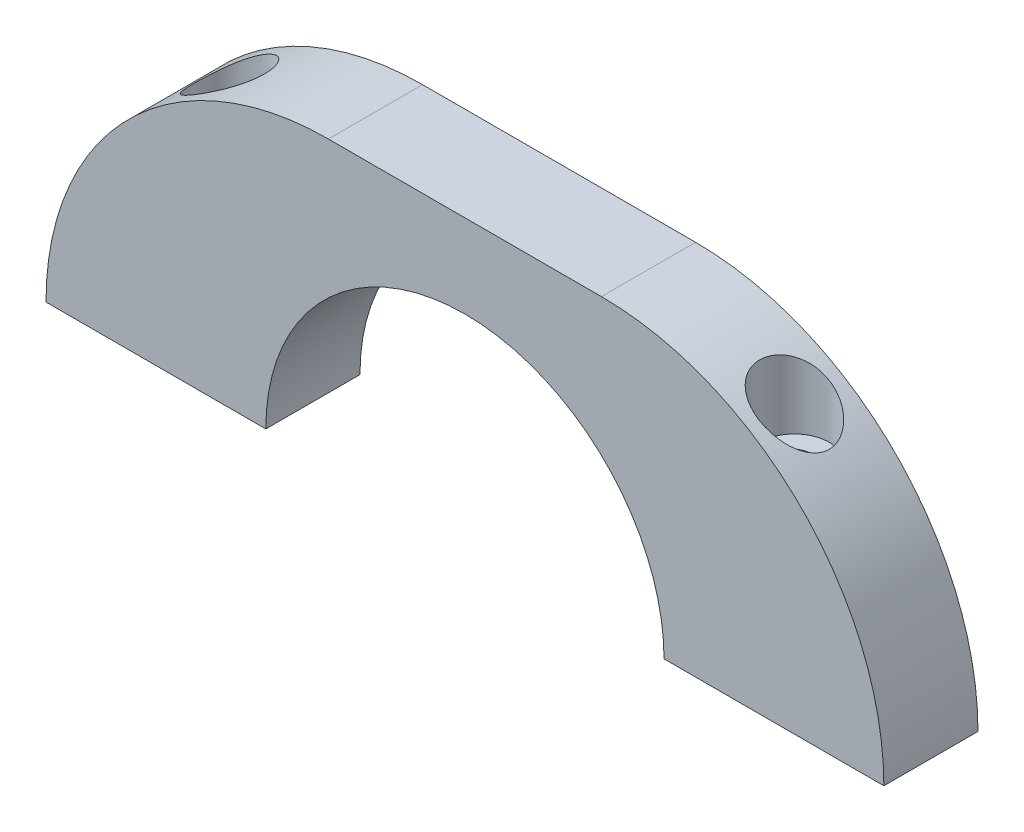
ISO-10303-21;
HEADER;
FILE_DESCRIPTION(('STEP AP214'),'2;1');
FILE_NAME('part.step','',(''),(''),'','','');
FILE_SCHEMA(('AUTOMOTIVE_DESIGN { 1 0 10303 214 1 1 1 1 }'));
ENDSEC;
DATA;
#1=APPLICATION_CONTEXT('core data for automotive mechanical design processes');
#2=APPLICATION_PROTOCOL_DEFINITION('international standard','automotive_design',2000,#1);
#3=PRODUCT_CONTEXT('',#1,'mechanical');
#4=PRODUCT('Part','Part','',(#3));
#5=PRODUCT_RELATED_PRODUCT_CATEGORY('part','',(#4));
#6=PRODUCT_DEFINITION_FORMATION('','',#4);
#7=PRODUCT_DEFINITION_CONTEXT('part definition',#1,'design');
#8=PRODUCT_DEFINITION('design','',#6,#7);
#9=PRODUCT_DEFINITION_SHAPE('','',#8);
#10=(LENGTH_UNIT() NAMED_UNIT(*) SI_UNIT(.MILLI.,.METRE.));
#11=(NAMED_UNIT(*) PLANE_ANGLE_UNIT() SI_UNIT($,.RADIAN.));
#12=(NAMED_UNIT(*) SI_UNIT($,.STERADIAN.) SOLID_ANGLE_UNIT());
#13=UNCERTAINTY_MEASURE_WITH_UNIT(LENGTH_MEASURE(1.E-05),#10,'distance_accuracy_value','');
#14=(GEOMETRIC_REPRESENTATION_CONTEXT(3) GLOBAL_UNCERTAINTY_ASSIGNED_CONTEXT((#13)) GLOBAL_UNIT_ASSIGNED_CONTEXT((#10,
#11,#12)) REPRESENTATION_CONTEXT('',''));
#15=CARTESIAN_POINT('',(0.,0.,0.));
#16=DIRECTION('',(0.,0.,1.));
#17=DIRECTION('',(1.,0.,0.));
#18=AXIS2_PLACEMENT_3D('',#15,#16,#17);
#19=CARTESIAN_POINT('',(30.,60.,0.));
#20=DIRECTION('',(0.,-1.,0.));
#21=DIRECTION('',(0.,0.,-1.));
#22=AXIS2_PLACEMENT_3D('',#19,#20,#21);
#23=CYLINDRICAL_SURFACE('',#22,1.7);
#24=CARTESIAN_POINT('',(30.,0.,0.));
#25=DIRECTION('',(0.,-1.,0.));
#26=DIRECTION('',(0.,0.,-1.));
#27=AXIS2_PLACEMENT_3D('',#24,#25,#26);
#28=CIRCLE('',#27,1.7);
#29=CARTESIAN_POINT('',(30.,0.,-1.7));
#30=VERTEX_POINT('',#29);
#31=EDGE_CURVE('E140',#30,#30,#28,.T.);
#32=CARTESIAN_POINT('',(30.,20.,0.));
#33=DIRECTION('',(0.,1.,0.));
#34=DIRECTION('',(0.,0.,1.));
#35=AXIS2_PLACEMENT_3D('',#32,#33,#34);
#36=CIRCLE('',#35,1.7);
#37=CARTESIAN_POINT('',(30.,20.,-1.7));
#38=VERTEX_POINT('',#37);
#39=EDGE_CURVE('E142',#38,#38,#36,.F.);
#40=CARTESIAN_POINT('',(30.,0.,-1.7));
#41=CARTESIAN_POINT('',(30.,0.208333333333334,-1.7));
#42=CARTESIAN_POINT('',(30.,0.416666666666667,-1.7));
#43=CARTESIAN_POINT('',(30.,0.833333333333334,-1.7));
#44=CARTESIAN_POINT('',(30.,1.04166666666667,-1.7));
#45=CARTESIAN_POINT('',(30.,1.45833333333333,-1.7));
#46=CARTESIAN_POINT('',(30.,1.66666666666667,-1.7));
#47=CARTESIAN_POINT('',(30.,2.08333333333334,-1.7));
#48=CARTESIAN_POINT('',(30.,2.29166666666667,-1.7));
#49=CARTESIAN_POINT('',(30.,2.70833333333333,-1.7));
#50=CARTESIAN_POINT('',(30.,2.91666666666666,-1.7));
#51=CARTESIAN_POINT('',(30.,3.33333333333333,-1.7));
#52=CARTESIAN_POINT('',(30.,3.54166666666666,-1.7));
#53=CARTESIAN_POINT('',(30.,3.95833333333333,-1.7));
#54=CARTESIAN_POINT('',(30.,4.16666666666666,-1.7));
#55=CARTESIAN_POINT('',(30.,4.58333333333333,-1.7));
#56=CARTESIAN_POINT('',(30.,4.79166666666666,-1.7));
#57=CARTESIAN_POINT('',(30.,5.20833333333333,-1.7));
#58=CARTESIAN_POINT('',(30.,5.41666666666666,-1.7));
#59=CARTESIAN_POINT('',(30.,5.83333333333333,-1.7));
#60=CARTESIAN_POINT('',(30.,6.04166666666667,-1.7));
#61=CARTESIAN_POINT('',(30.,6.45833333333333,-1.7));
#62=CARTESIAN_POINT('',(30.,6.66666666666667,-1.7));
#63=CARTESIAN_POINT('',(30.,7.08333333333333,-1.7));
#64=CARTESIAN_POINT('',(30.,7.29166666666666,-1.7));
#65=CARTESIAN_POINT('',(30.,7.70833333333333,-1.7));
#66=CARTESIAN_POINT('',(30.,7.91666666666666,-1.7));
#67=CARTESIAN_POINT('',(30.,8.33333333333333,-1.7));
#68=CARTESIAN_POINT('',(30.,8.54166666666666,-1.7));
#69=CARTESIAN_POINT('',(30.,8.95833333333333,-1.7));
#70=CARTESIAN_POINT('',(30.,9.16666666666666,-1.7));
#71=CARTESIAN_POINT('',(30.,9.58333333333333,-1.7));
#72=CARTESIAN_POINT('',(30.,9.79166666666666,-1.7));
#73=CARTESIAN_POINT('',(30.,10.2083333333333,-1.7));
#74=CARTESIAN_POINT('',(30.,10.4166666666667,-1.7));
#75=CARTESIAN_POINT('',(30.,10.8333333333333,-1.7));
#76=CARTESIAN_POINT('',(30.,11.0416666666667,-1.7));
#77=CARTESIAN_POINT('',(30.,11.4583333333333,-1.7));
#78=CARTESIAN_POINT('',(30.,11.6666666666667,-1.7));
#79=CARTESIAN_POINT('',(30.,12.0833333333333,-1.7));
#80=CARTESIAN_POINT('',(30.,12.2916666666667,-1.7));
#81=CARTESIAN_POINT('',(30.,12.7083333333333,-1.7));
#82=CARTESIAN_POINT('',(30.,12.9166666666667,-1.7));
#83=CARTESIAN_POINT('',(30.,13.3333333333333,-1.7));
#84=CARTESIAN_POINT('',(30.,13.5416666666667,-1.7));
#85=CARTESIAN_POINT('',(30.,13.9583333333333,-1.7));
#86=CARTESIAN_POINT('',(30.,14.1666666666667,-1.7));
#87=CARTESIAN_POINT('',(30.,14.5833333333333,-1.7));
#88=CARTESIAN_POINT('',(30.,14.7916666666667,-1.7));
#89=CARTESIAN_POINT('',(30.,15.2083333333333,-1.7));
#90=CARTESIAN_POINT('',(30.,15.4166666666667,-1.7));
#91=CARTESIAN_POINT('',(30.,15.8333333333333,-1.7));
#92=CARTESIAN_POINT('',(30.,16.0416666666667,-1.7));
#93=CARTESIAN_POINT('',(30.,16.4583333333333,-1.7));
#94=CARTESIAN_POINT('',(30.,16.6666666666667,-1.7));
#95=CARTESIAN_POINT('',(30.,17.0833333333333,-1.7));
#96=CARTESIAN_POINT('',(30.,17.2916666666667,-1.7));
#97=CARTESIAN_POINT('',(30.,17.7083333333333,-1.7));
#98=CARTESIAN_POINT('',(30.,17.9166666666667,-1.7));
#99=CARTESIAN_POINT('',(30.,18.3333333333333,-1.7));
#100=CARTESIAN_POINT('',(30.,18.5416666666667,-1.7));
#101=CARTESIAN_POINT('',(30.,18.9583333333333,-1.7));
#102=CARTESIAN_POINT('',(30.,19.1666666666667,-1.7));
#103=CARTESIAN_POINT('',(30.,19.5833333333333,-1.7));
#104=CARTESIAN_POINT('',(30.,19.7916666666667,-1.7));
#105=CARTESIAN_POINT('',(30.,20.,-1.7));
#106=B_SPLINE_CURVE_WITH_KNOTS('',3,(#40,#41,#42,#43,#44,#45,#46,#47,#48,#49,#50,#51,#52,#53,
#54,#55,#56,#57,#58,#59,#60,#61,#62,#63,#64,#65,#66,#67,#68,#69,#70,#71,#72,#73,#74,#75,#76,#77,
#78,#79,#80,#81,#82,#83,#84,#85,#86,#87,#88,#89,#90,#91,#92,#93,#94,#95,#96,#97,#98,#99,#100,
#101,#102,#103,#104,#105),.UNSPECIFIED.,.F.,.F.,(4,2,2,2,2,2,2,2,2,2,2,2,2,2,2,2,2,2,2,2,2,2,2,
2,2,2,2,2,2,2,2,2,4),(0.,0.625000000000001,1.25,1.875,2.5,3.125,3.75,4.375,5.,5.625,6.25,6.875,
7.49999999999999,8.12499999999999,8.74999999999999,9.37499999999999,9.99999999999999,10.625,
11.25,11.875,12.5,13.125,13.75,14.375,15.,15.625,16.25,16.875,17.5,18.125,18.75,19.375,20.),.UNSPECIFIED.);
#107=EDGE_CURVE('BSEAM38',#30,#38,#106,.T.);
#108=ORIENTED_EDGE('',*,*,#31,.T.);
#109=ORIENTED_EDGE('',*,*,#39,.F.);
#110=ORIENTED_EDGE('',*,*,#107,.T.);
#111=ORIENTED_EDGE('',*,*,#107,.F.);
#112=EDGE_LOOP('',(#108,#110,#109,#111));
#113=FACE_BOUND('',#112,.T.);
#114=ADVANCED_FACE('F38',(#113),#23,.F.);
#115=CARTESIAN_POINT('',(-30.,60.,0.));
#116=DIRECTION('',(0.,-1.,0.));
#117=DIRECTION('',(0.,0.,-1.));
#118=AXIS2_PLACEMENT_3D('',#115,#116,#117);
#119=CYLINDRICAL_SURFACE('',#118,1.7);
#120=CARTESIAN_POINT('',(-30.,0.,0.));
#121=DIRECTION('',(0.,-1.,0.));
#122=DIRECTION('',(0.,0.,-1.));
#123=AXIS2_PLACEMENT_3D('',#120,#121,#122);
#124=CIRCLE('',#123,1.7);
#125=CARTESIAN_POINT('',(-30.,0.,-1.7));
#126=VERTEX_POINT('',#125);
#127=EDGE_CURVE('E118',#126,#126,#124,.T.);
#128=CARTESIAN_POINT('',(-30.,20.,0.));
#129=DIRECTION('',(0.,1.,0.));
#130=DIRECTION('',(0.,0.,1.));
#131=AXIS2_PLACEMENT_3D('',#128,#129,#130);
#132=CIRCLE('',#131,1.7);
#133=CARTESIAN_POINT('',(-30.,20.,-1.7));
#134=VERTEX_POINT('',#133);
#135=EDGE_CURVE('E137',#134,#134,#132,.F.);
#136=CARTESIAN_POINT('',(-30.,0.,-1.7));
#137=CARTESIAN_POINT('',(-30.,0.208333333333334,-1.7));
#138=CARTESIAN_POINT('',(-30.,0.416666666666667,-1.7));
#139=CARTESIAN_POINT('',(-30.,0.833333333333334,-1.7));
#140=CARTESIAN_POINT('',(-30.,1.04166666666667,-1.7));
#141=CARTESIAN_POINT('',(-30.,1.45833333333333,-1.7));
#142=CARTESIAN_POINT('',(-30.,1.66666666666667,-1.7));
#143=CARTESIAN_POINT('',(-30.,2.08333333333334,-1.7));
#144=CARTESIAN_POINT('',(-30.,2.29166666666667,-1.7));
#145=CARTESIAN_POINT('',(-30.,2.70833333333333,-1.7));
#146=CARTESIAN_POINT('',(-30.,2.91666666666666,-1.7));
#147=CARTESIAN_POINT('',(-30.,3.33333333333333,-1.7));
#148=CARTESIAN_POINT('',(-30.,3.54166666666666,-1.7));
#149=CARTESIAN_POINT('',(-30.,3.95833333333333,-1.7));
#150=CARTESIAN_POINT('',(-30.,4.16666666666666,-1.7));
#151=CARTESIAN_POINT('',(-30.,4.58333333333333,-1.7));
#152=CARTESIAN_POINT('',(-30.,4.79166666666666,-1.7));
#153=CARTESIAN_POINT('',(-30.,5.20833333333333,-1.7));
#154=CARTESIAN_POINT('',(-30.,5.41666666666666,-1.7));
#155=CARTESIAN_POINT('',(-30.,5.83333333333333,-1.7));
#156=CARTESIAN_POINT('',(-30.,6.04166666666667,-1.7));
#157=CARTESIAN_POINT('',(-30.,6.45833333333333,-1.7));
#158=CARTESIAN_POINT('',(-30.,6.66666666666667,-1.7));
#159=CARTESIAN_POINT('',(-30.,7.08333333333333,-1.7));
#160=CARTESIAN_POINT('',(-30.,7.29166666666666,-1.7));
#161=CARTESIAN_POINT('',(-30.,7.70833333333333,-1.7));
#162=CARTESIAN_POINT('',(-30.,7.91666666666666,-1.7));
#163=CARTESIAN_POINT('',(-30.,8.33333333333333,-1.7));
#164=CARTESIAN_POINT('',(-30.,8.54166666666666,-1.7));
#165=CARTESIAN_POINT('',(-30.,8.95833333333333,-1.7));
#166=CARTESIAN_POINT('',(-30.,9.16666666666666,-1.7));
#167=CARTESIAN_POINT('',(-30.,9.58333333333333,-1.7));
#168=CARTESIAN_POINT('',(-30.,9.79166666666666,-1.7));
#169=CARTESIAN_POINT('',(-30.,10.2083333333333,-1.7));
#170=CARTESIAN_POINT('',(-30.,10.4166666666667,-1.7));
#171=CARTESIAN_POINT('',(-30.,10.8333333333333,-1.7));
#172=CARTESIAN_POINT('',(-30.,11.0416666666667,-1.7));
#173=CARTESIAN_POINT('',(-30.,11.4583333333333,-1.7));
#174=CARTESIAN_POINT('',(-30.,11.6666666666667,-1.7));
#175=CARTESIAN_POINT('',(-30.,12.0833333333333,-1.7));
#176=CARTESIAN_POINT('',(-30.,12.2916666666667,-1.7));
#177=CARTESIAN_POINT('',(-30.,12.7083333333333,-1.7));
#178=CARTESIAN_POINT('',(-30.,12.9166666666667,-1.7));
#179=CARTESIAN_POINT('',(-30.,13.3333333333333,-1.7));
#180=CARTESIAN_POINT('',(-30.,13.5416666666667,-1.7));
#181=CARTESIAN_POINT('',(-30.,13.9583333333333,-1.7));
#182=CARTESIAN_POINT('',(-30.,14.1666666666667,-1.7));
#183=CARTESIAN_POINT('',(-30.,14.5833333333333,-1.7));
#184=CARTESIAN_POINT('',(-30.,14.7916666666667,-1.7));
#185=CARTESIAN_POINT('',(-30.,15.2083333333333,-1.7));
#186=CARTESIAN_POINT('',(-30.,15.4166666666667,-1.7));
#187=CARTESIAN_POINT('',(-30.,15.8333333333333,-1.7));
#188=CARTESIAN_POINT('',(-30.,16.0416666666667,-1.7));
#189=CARTESIAN_POINT('',(-30.,16.4583333333333,-1.7));
#190=CARTESIAN_POINT('',(-30.,16.6666666666667,-1.7));
#191=CARTESIAN_POINT('',(-30.,17.0833333333333,-1.7));
#192=CARTESIAN_POINT('',(-30.,17.2916666666667,-1.7));
#193=CARTESIAN_POINT('',(-30.,17.7083333333333,-1.7));
#194=CARTESIAN_POINT('',(-30.,17.9166666666667,-1.7));
#195=CARTESIAN_POINT('',(-30.,18.3333333333333,-1.7));
#196=CARTESIAN_POINT('',(-30.,18.5416666666667,-1.7));
#197=CARTESIAN_POINT('',(-30.,18.9583333333333,-1.7));
#198=CARTESIAN_POINT('',(-30.,19.1666666666667,-1.7));
#199=CARTESIAN_POINT('',(-30.,19.5833333333333,-1.7));
#200=CARTESIAN_POINT('',(-30.,19.7916666666667,-1.7));
#201=CARTESIAN_POINT('',(-30.,20.,-1.7));
#202=B_SPLINE_CURVE_WITH_KNOTS('',3,(#136,#137,#138,#139,#140,#141,#142,#143,#144,#145,#146,
#147,#148,#149,#150,#151,#152,#153,#154,#155,#156,#157,#158,#159,#160,#161,#162,#163,#164,#165,
#166,#167,#168,#169,#170,#171,#172,#173,#174,#175,#176,#177,#178,#179,#180,#181,#182,#183,#184,
#185,#186,#187,#188,#189,#190,#191,#192,#193,#194,#195,#196,#197,#198,#199,#200,#201),
.UNSPECIFIED.,.F.,.F.,(4,2,2,2,2,2,2,2,2,2,2,2,2,2,2,2,2,2,2,2,2,2,2,2,2,2,2,2,2,2,2,2,4),(0.,
0.625000000000001,1.25,1.875,2.5,3.125,3.75,4.375,5.,5.625,6.25,6.875,7.49999999999999,
8.12499999999999,8.74999999999999,9.37499999999999,9.99999999999999,10.625,11.25,11.875,12.5,
13.125,13.75,14.375,15.,15.625,16.25,16.875,17.5,18.125,18.75,19.375,20.),.UNSPECIFIED.);
#203=EDGE_CURVE('BSEAM186',#126,#134,#202,.T.);
#204=ORIENTED_EDGE('',*,*,#127,.T.);
#205=ORIENTED_EDGE('',*,*,#135,.F.);
#206=ORIENTED_EDGE('',*,*,#203,.T.);
#207=ORIENTED_EDGE('',*,*,#203,.F.);
#208=EDGE_LOOP('',(#204,#206,#205,#207));
#209=FACE_BOUND('',#208,.T.);
#210=ADVANCED_FACE('F186',(#209),#119,.F.);
#211=CARTESIAN_POINT('',(0.,0.,0.));
#212=DIRECTION('',(0.,1.,0.));
#213=DIRECTION('',(0.,0.,1.));
#214=AXIS2_PLACEMENT_3D('',#211,#212,#213);
#215=PLANE('',#214);
#216=ORIENTED_EDGE('',*,*,#127,.F.);
#217=EDGE_LOOP('',(#216));
#218=FACE_BOUND('',#217,.T.);
#219=DIRECTION('',(-1.,0.,0.));
#220=VECTOR('',#219,1.);
#221=CARTESIAN_POINT('',(-44.5,0.,-5.));
#222=LINE('',#221,#220);
#223=CARTESIAN_POINT('',(-21.15,0.,-5.));
#224=VERTEX_POINT('',#223);
#225=CARTESIAN_POINT('',(-44.5,0.,-5.));
#226=VERTEX_POINT('',#225);
#227=EDGE_CURVE('E220',#224,#226,#222,.T.);
#228=ORIENTED_EDGE('',*,*,#227,.F.);
#229=DIRECTION('',(0.,0.,1.));
#230=VECTOR('',#229,1.);
#231=CARTESIAN_POINT('',(-21.15,0.,-15.));
#232=LINE('',#231,#230);
#233=CARTESIAN_POINT('',(-21.15,0.,5.));
#234=VERTEX_POINT('',#233);
#235=EDGE_CURVE('E108',#224,#234,#232,.T.);
#236=ORIENTED_EDGE('',*,*,#235,.T.);
#237=DIRECTION('',(1.,0.,0.));
#238=VECTOR('',#237,1.);
#239=CARTESIAN_POINT('',(-44.5,0.,5.));
#240=LINE('',#239,#238);
#241=CARTESIAN_POINT('',(-44.5,0.,5.));
#242=VERTEX_POINT('',#241);
#243=EDGE_CURVE('E116',#242,#234,#240,.T.);
#244=ORIENTED_EDGE('',*,*,#243,.F.);
#245=DIRECTION('',(0.,0.,1.));
#246=VECTOR('',#245,1.);
#247=CARTESIAN_POINT('',(-44.5,0.,-5.));
#248=LINE('',#247,#246);
#249=EDGE_CURVE('E124',#226,#242,#248,.T.);
#250=ORIENTED_EDGE('',*,*,#249,.F.);
#251=EDGE_LOOP('',(#228,#236,#244,#250));
#252=FACE_BOUND('',#251,.T.);
#253=ADVANCED_FACE('F190',(#218,#252),#215,.F.);
#254=CARTESIAN_POINT('',(-44.5,30.,-5.));
#255=DIRECTION('',(0.,0.,1.));
#256=DIRECTION('',(1.,0.,0.));
#257=AXIS2_PLACEMENT_3D('',#254,#255,#256);
#258=PLANE('',#257);
#259=DIRECTION('',(-1.,0.,0.));
#260=VECTOR('',#259,1.);
#261=CARTESIAN_POINT('',(-44.5,30.,-5.));
#262=LINE('',#261,#260);
#263=CARTESIAN_POINT('',(14.5,30.,-5.));
#264=VERTEX_POINT('',#263);
#265=CARTESIAN_POINT('',(-14.5,30.,-5.));
#266=VERTEX_POINT('',#265);
#267=EDGE_CURVE('E128',#264,#266,#262,.T.);
#268=ORIENTED_EDGE('',*,*,#267,.F.);
#269=CARTESIAN_POINT('',(14.5,0.,-5.));
#270=DIRECTION('',(0.,0.,1.));
#271=DIRECTION('',(1.,0.,0.));
#272=AXIS2_PLACEMENT_3D('',#269,#270,#271);
#273=CIRCLE('',#272,30.);
#274=CARTESIAN_POINT('',(44.5,0.,-5.));
#275=VERTEX_POINT('',#274);
#276=EDGE_CURVE('E156',#264,#275,#273,.F.);
#277=ORIENTED_EDGE('',*,*,#276,.T.);
#278=CARTESIAN_POINT('',(21.15,0.,-5.));
#279=VERTEX_POINT('',#278);
#280=EDGE_CURVE('E130',#275,#279,#222,.T.);
#281=ORIENTED_EDGE('',*,*,#280,.T.);
#282=CARTESIAN_POINT('',(0.,0.,-5.));
#283=DIRECTION('',(0.,0.,1.));
#284=DIRECTION('',(1.,0.,0.));
#285=AXIS2_PLACEMENT_3D('',#282,#283,#284);
#286=CIRCLE('',#285,21.15);
#287=EDGE_CURVE('E102',#279,#224,#286,.T.);
#288=ORIENTED_EDGE('',*,*,#287,.T.);
#289=ORIENTED_EDGE('',*,*,#227,.T.);
#290=CARTESIAN_POINT('',(-14.5,0.,-5.));
#291=DIRECTION('',(0.,0.,1.));
#292=DIRECTION('',(1.,0.,0.));
#293=AXIS2_PLACEMENT_3D('',#290,#291,#292);
#294=CIRCLE('',#293,30.);
#295=EDGE_CURVE('E153',#226,#266,#294,.F.);
#296=ORIENTED_EDGE('',*,*,#295,.T.);
#297=EDGE_LOOP('',(#268,#277,#281,#288,#289,#296));
#298=FACE_BOUND('',#297,.T.);
#299=ADVANCED_FACE('F202',(#298),#258,.F.);
#300=CARTESIAN_POINT('',(-44.5,30.,5.));
#301=DIRECTION('',(0.,0.,-1.));
#302=DIRECTION('',(-1.,0.,0.));
#303=AXIS2_PLACEMENT_3D('',#300,#301,#302);
#304=PLANE('',#303);
#305=CARTESIAN_POINT('',(21.15,0.,5.));
#306=VERTEX_POINT('',#305);
#307=CARTESIAN_POINT('',(44.5,0.,5.));
#308=VERTEX_POINT('',#307);
#309=EDGE_CURVE('E113',#306,#308,#240,.T.);
#310=ORIENTED_EDGE('',*,*,#309,.T.);
#311=CARTESIAN_POINT('',(14.5,0.,5.));
#312=DIRECTION('',(0.,0.,-1.));
#313=DIRECTION('',(-1.,0.,0.));
#314=AXIS2_PLACEMENT_3D('',#311,#312,#313);
#315=CIRCLE('',#314,30.);
#316=CARTESIAN_POINT('',(14.5,30.,5.));
#317=VERTEX_POINT('',#316);
#318=EDGE_CURVE('E11',#308,#317,#315,.F.);
#319=ORIENTED_EDGE('',*,*,#318,.T.);
#320=DIRECTION('',(1.,0.,0.));
#321=VECTOR('',#320,1.);
#322=CARTESIAN_POINT('',(-44.5,30.,5.));
#323=LINE('',#322,#321);
#324=CARTESIAN_POINT('',(-14.5,30.,5.));
#325=VERTEX_POINT('',#324);
#326=EDGE_CURVE('E109',#325,#317,#323,.T.);
#327=ORIENTED_EDGE('',*,*,#326,.F.);
#328=CARTESIAN_POINT('',(-14.5,0.,5.));
#329=DIRECTION('',(0.,0.,-1.));
#330=DIRECTION('',(-1.,0.,0.));
#331=AXIS2_PLACEMENT_3D('',#328,#329,#330);
#332=CIRCLE('',#331,30.);
#333=EDGE_CURVE('E52',#325,#242,#332,.F.);
#334=ORIENTED_EDGE('',*,*,#333,.T.);
#335=ORIENTED_EDGE('',*,*,#243,.T.);
#336=CARTESIAN_POINT('',(0.,0.,5.));
#337=DIRECTION('',(0.,0.,1.));
#338=DIRECTION('',(1.,0.,0.));
#339=AXIS2_PLACEMENT_3D('',#336,#337,#338);
#340=CIRCLE('',#339,21.15);
#341=EDGE_CURVE('E99',#306,#234,#340,.T.);
#342=ORIENTED_EDGE('',*,*,#341,.F.);
#343=EDGE_LOOP('',(#310,#319,#327,#334,#335,#342));
#344=FACE_BOUND('',#343,.T.);
#345=ADVANCED_FACE('F112',(#344),#304,.F.);
#346=CARTESIAN_POINT('',(0.,30.,0.));
#347=DIRECTION('',(0.,1.,0.));
#348=DIRECTION('',(0.,0.,1.));
#349=AXIS2_PLACEMENT_3D('',#346,#347,#348);
#350=PLANE('',#349);
#351=ORIENTED_EDGE('',*,*,#326,.T.);
#352=DIRECTION('',(0.,0.,-1.));
#353=VECTOR('',#352,1.);
#354=CARTESIAN_POINT('',(14.5,30.,-4.99999999999998));
#355=LINE('',#354,#353);
#356=EDGE_CURVE('E149',#317,#264,#355,.T.);
#357=ORIENTED_EDGE('',*,*,#356,.T.);
#358=ORIENTED_EDGE('',*,*,#267,.T.);
#359=DIRECTION('',(0.,0.,1.));
#360=VECTOR('',#359,1.);
#361=CARTESIAN_POINT('',(-14.5,30.,5.));
#362=LINE('',#361,#360);
#363=EDGE_CURVE('E136',#266,#325,#362,.T.);
#364=ORIENTED_EDGE('',*,*,#363,.T.);
#365=EDGE_LOOP('',(#351,#357,#358,#364));
#366=FACE_BOUND('',#365,.T.);
#367=ADVANCED_FACE('F194',(#366),#350,.T.);
#368=ORIENTED_EDGE('',*,*,#31,.F.);
#369=EDGE_LOOP('',(#368));
#370=FACE_BOUND('',#369,.T.);
#371=ORIENTED_EDGE('',*,*,#309,.F.);
#372=DIRECTION('',(0.,0.,1.));
#373=VECTOR('',#372,1.);
#374=CARTESIAN_POINT('',(21.15,0.,-15.));
#375=LINE('',#374,#373);
#376=EDGE_CURVE('E96',#306,#279,#375,.F.);
#377=ORIENTED_EDGE('',*,*,#376,.T.);
#378=ORIENTED_EDGE('',*,*,#280,.F.);
#379=DIRECTION('',(0.,0.,-1.));
#380=VECTOR('',#379,1.);
#381=CARTESIAN_POINT('',(44.5,0.,-5.));
#382=LINE('',#381,#380);
#383=EDGE_CURVE('E122',#308,#275,#382,.T.);
#384=ORIENTED_EDGE('',*,*,#383,.F.);
#385=EDGE_LOOP('',(#371,#377,#378,#384));
#386=FACE_BOUND('',#385,.T.);
#387=ADVANCED_FACE('F120',(#370,#386),#215,.F.);
#388=CARTESIAN_POINT('',(0.,0.,-15.));
#389=DIRECTION('',(0.,0.,1.));
#390=DIRECTION('',(1.,0.,0.));
#391=AXIS2_PLACEMENT_3D('',#388,#389,#390);
#392=CYLINDRICAL_SURFACE('',#391,21.15);
#393=ORIENTED_EDGE('',*,*,#287,.F.);
#394=ORIENTED_EDGE('',*,*,#376,.F.);
#395=ORIENTED_EDGE('',*,*,#341,.T.);
#396=ORIENTED_EDGE('',*,*,#235,.F.);
#397=EDGE_LOOP('',(#393,#394,#395,#396));
#398=FACE_BOUND('',#397,.T.);
#399=ADVANCED_FACE('F98',(#398),#392,.F.);
#400=CARTESIAN_POINT('',(-30.,20.,0.));
#401=DIRECTION('',(0.,1.,0.));
#402=DIRECTION('',(0.,0.,1.));
#403=AXIS2_PLACEMENT_3D('',#400,#401,#402);
#404=PLANE('',#403);
#405=CARTESIAN_POINT('',(-30.,20.,0.));
#406=DIRECTION('',(0.,1.,0.));
#407=DIRECTION('',(0.,0.,1.));
#408=AXIS2_PLACEMENT_3D('',#405,#406,#407);
#409=CIRCLE('',#408,3.7);
#410=CARTESIAN_POINT('',(-30.,20.,3.7));
#411=VERTEX_POINT('',#410);
#412=EDGE_CURVE('E141',#411,#411,#409,.T.);
#413=ORIENTED_EDGE('',*,*,#412,.T.);
#414=EDGE_LOOP('',(#413));
#415=FACE_BOUND('',#414,.T.);
#416=ORIENTED_EDGE('',*,*,#135,.T.);
#417=EDGE_LOOP('',(#416));
#418=FACE_BOUND('',#417,.T.);
#419=ADVANCED_FACE('F176',(#415,#418),#404,.T.);
#420=CARTESIAN_POINT('',(-30.,20.,0.));
#421=DIRECTION('',(0.,1.,0.));
#422=DIRECTION('',(0.,0.,1.));
#423=AXIS2_PLACEMENT_3D('',#420,#421,#422);
#424=CYLINDRICAL_SURFACE('',#423,3.7);
#425=ORIENTED_EDGE('',*,*,#412,.F.);
#426=EDGE_LOOP('',(#425));
#427=FACE_BOUND('',#426,.T.);
#428=CARTESIAN_POINT('',(-28.3940437890616,26.5886356774401,-3.33330236380514));
#429=CARTESIAN_POINT('',(-28.50026311556,26.533130356311,-3.3844791544133));
#430=CARTESIAN_POINT('',(-28.6081845990159,26.4759217527605,-3.43021389149125));
#431=CARTESIAN_POINT('',(-28.8264129412796,26.3584767273524,-3.51087465635546));
#432=CARTESIAN_POINT('',(-28.9367206590352,26.2982392045145,-3.54579672034911));
#433=CARTESIAN_POINT('',(-29.2699904273054,26.113437516327,-3.63454368891424));
#434=CARTESIAN_POINT('',(-29.4951833648938,25.9848444223668,-3.67229478365291));
#435=CARTESIAN_POINT('',(-29.9431154169658,25.7211510410183,-3.7063563060977));
#436=CARTESIAN_POINT('',(-30.1658611167516,25.5860848303595,-3.7028641392141));
#437=CARTESIAN_POINT('',(-30.6048283914703,25.312081032207,-3.65689385139073));
#438=CARTESIAN_POINT('',(-30.8210493756979,25.1731430963696,-3.61441221146928));
#439=CARTESIAN_POINT('',(-31.2628125344785,24.88141384431,-3.48614950799095));
#440=CARTESIAN_POINT('',(-31.4872337359992,24.7285822892441,-3.3965781201685));
#441=CARTESIAN_POINT('',(-31.9170651613658,24.4277419976144,-3.17386699567775));
#442=CARTESIAN_POINT('',(-32.1224771912914,24.2797328037411,-3.04073140354919));
#443=CARTESIAN_POINT('',(-32.4733692034978,24.0207586624134,-2.75927971464224));
#444=CARTESIAN_POINT('',(-32.6230066020996,23.9078919845126,-2.61789448951958));
#445=CARTESIAN_POINT('',(-32.900354714635,23.6950919389729,-2.30678621003305));
#446=CARTESIAN_POINT('',(-33.0280975689787,23.5951396674746,-2.13710542767659));
#447=CARTESIAN_POINT('',(-33.2329809085557,23.4326482753094,-1.80761350083724));
#448=CARTESIAN_POINT('',(-33.3151314317877,23.3666276425407,-1.6526813781526));
#449=CARTESIAN_POINT('',(-33.4223634061053,23.2797397632178,-1.40901613536662));
#450=CARTESIAN_POINT('',(-33.4554486085582,23.2527952857601,-1.32589231438665));
#451=CARTESIAN_POINT('',(-33.5158355068468,23.2034376935656,-1.15628370508035));
#452=CARTESIAN_POINT('',(-33.543139790865,23.1810225512004,-1.0698004414266));
#453=CARTESIAN_POINT('',(-33.5917373634035,23.14101480192,-0.893240210594395));
#454=CARTESIAN_POINT('',(-33.6129778716701,23.1234645762614,-0.803139039310839));
#455=CARTESIAN_POINT('',(-33.6487367433381,23.093861122279,-0.620764347417104));
#456=CARTESIAN_POINT('',(-33.663258488012,23.0818051289841,-0.528491944121348));
#457=CARTESIAN_POINT('',(-33.6852953015761,23.0634917304581,-0.342574760055343));
#458=CARTESIAN_POINT('',(-33.6928129393042,23.0572321993119,-0.248930495240637));
#459=CARTESIAN_POINT('',(-33.7006880312653,23.0506747498125,-0.0611394944865986));
#460=CARTESIAN_POINT('',(-33.7010463510735,23.050376110776,0.0330071793338091));
#461=CARTESIAN_POINT('',(-33.6950093959314,23.0554033959939,0.208868035039191));
#462=CARTESIAN_POINT('',(-33.6894712733383,23.0600154658566,0.29063358956159));
#463=CARTESIAN_POINT('',(-33.6730433829513,23.073675793837,0.453260182287458));
#464=CARTESIAN_POINT('',(-33.6621518730597,23.0827254960455,0.534120917278112));
#465=CARTESIAN_POINT('',(-33.6216807567593,23.1162844410368,0.774425660928216));
#466=CARTESIAN_POINT('',(-33.5842984069269,23.1472087746887,0.931758446672007));
#467=CARTESIAN_POINT('',(-33.4904513496051,23.224263384022,1.23801545705881));
#468=CARTESIAN_POINT('',(-33.4338306633022,23.270517874347,1.38685895018941));
#469=CARTESIAN_POINT('',(-33.3041446282032,23.3754382302286,1.67250193110528));
#470=CARTESIAN_POINT('',(-33.2310686970596,23.4341120811969,1.8092935892604));
#471=CARTESIAN_POINT('',(-33.0370683731619,23.5880927711415,2.12448563909679));
#472=CARTESIAN_POINT('',(-32.9089727928258,23.6884031404477,2.29604608057768));
#473=CARTESIAN_POINT('',(-32.6305148000262,23.9022035656561,2.61048809109204));
#474=CARTESIAN_POINT('',(-32.480118610329,24.015713556864,2.75332536804362));
#475=CARTESIAN_POINT('',(-32.1597324966817,24.2522988240549,3.01137654381251));
#476=CARTESIAN_POINT('',(-31.9895128072825,24.3754794611269,3.12620627198574));
#477=CARTESIAN_POINT('',(-31.6350234511895,24.6259642819553,3.32536229043289));
#478=CARTESIAN_POINT('',(-31.4507553369858,24.7532680091778,3.40969194536815));
#479=CARTESIAN_POINT('',(-31.0374332570374,25.031698330061,3.55954250360218));
#480=CARTESIAN_POINT('',(-30.8062740648618,25.1830027825473,3.61897777319006));
#481=CARTESIAN_POINT('',(-30.3343774403539,25.4823554083917,3.69258252959793));
#482=CARTESIAN_POINT('',(-30.093633760423,25.6304013567621,3.70672198477211));
#483=CARTESIAN_POINT('',(-29.7279142492055,25.848241674366,3.69206623734017));
#484=CARTESIAN_POINT('',(-29.6037783202001,25.9209649207674,3.68085664219586));
#485=CARTESIAN_POINT('',(-29.3558650243861,26.063838346452,3.64564716572443));
#486=CARTESIAN_POINT('',(-29.2320875132872,26.1339897522356,3.62165346817084));
#487=CARTESIAN_POINT('',(-28.9860234227388,26.2711816846759,3.56060741292976));
#488=CARTESIAN_POINT('',(-28.8637369230035,26.3382220455392,3.52355436018732));
#489=CARTESIAN_POINT('',(-28.6220257919419,26.4686082188282,3.43623090154432));
#490=CARTESIAN_POINT('',(-28.5025993789925,26.5319563684595,3.38596897049429));
#491=CARTESIAN_POINT('',(-28.2790984682285,26.6486549401613,3.277564859402));
#492=CARTESIAN_POINT('',(-28.1746409716565,26.7023840899366,3.22061921532155));
#493=CARTESIAN_POINT('',(-27.9704091212923,26.805991473707,3.09597490044852));
#494=CARTESIAN_POINT('',(-27.8706320753321,26.8558719323646,3.02828251185816));
#495=CARTESIAN_POINT('',(-27.676977724046,26.9514176678244,2.88240454855775));
#496=CARTESIAN_POINT('',(-27.5830974397521,26.9970850785601,2.80422433578809));
#497=CARTESIAN_POINT('',(-27.4024551817734,27.083882506678,2.63777139102149));
#498=CARTESIAN_POINT('',(-27.3156920914512,27.1250132361838,2.54950024744207));
#499=CARTESIAN_POINT('',(-27.1614179691362,27.197330275392,2.37573607489978));
#500=CARTESIAN_POINT('',(-27.0928756445396,27.2291130275618,2.29140426815396));
#501=CARTESIAN_POINT('',(-26.962925589741,27.288836535055,2.11614618928198));
#502=CARTESIAN_POINT('',(-26.9015168479798,27.3167778352088,2.02522085511112));
#503=CARTESIAN_POINT('',(-26.7866237272458,27.3686472355687,1.83747646740672));
#504=CARTESIAN_POINT('',(-26.7331353439531,27.3925773645281,1.74066042722872));
#505=CARTESIAN_POINT('',(-26.634745410708,27.4363054211736,1.54186821942775));
#506=CARTESIAN_POINT('',(-26.5898431804507,27.456103676251,1.43989246143396));
#507=CARTESIAN_POINT('',(-26.5132615254754,27.4896910939716,1.24207679092018));
#508=CARTESIAN_POINT('',(-26.4807091404586,27.5038830393788,1.14664205120812));
#509=CARTESIAN_POINT('',(-26.423404173133,27.5287742351322,0.952975088554038));
#510=CARTESIAN_POINT('',(-26.3986541202333,27.5394723528678,0.854741969646048));
#511=CARTESIAN_POINT('',(-26.3572690439004,27.5573162537723,0.656334070799627));
#512=CARTESIAN_POINT('',(-26.3406285180845,27.5644644456588,0.556160655485633));
#513=CARTESIAN_POINT('',(-26.3156263706601,27.5751910179224,0.354557600438236));
#514=CARTESIAN_POINT('',(-26.3072677154709,27.5787681192016,0.253127523752408));
#515=CARTESIAN_POINT('',(-26.299147926621,27.5822429368111,0.0549902373299262));
#516=CARTESIAN_POINT('',(-26.2989745505346,27.5823170760622,-0.041697242969287));
#517=CARTESIAN_POINT('',(-26.3061917749428,27.5792286124701,-0.234771431724385));
#518=CARTESIAN_POINT('',(-26.3135850483479,27.5760648658472,-0.331158021822811));
#519=CARTESIAN_POINT('',(-26.3358599554644,27.5665117073804,-0.522856764577136));
#520=CARTESIAN_POINT('',(-26.3507378411893,27.5601239100035,-0.618169430610583));
#521=CARTESIAN_POINT('',(-26.3878151315772,27.5441509037848,-0.807097942131065));
#522=CARTESIAN_POINT('',(-26.4100172456454,27.5345645116921,-0.900713146146607));
#523=CARTESIAN_POINT('',(-26.4869240611471,27.5012150336574,-1.17663837851227));
#524=CARTESIAN_POINT('',(-26.5521163941541,27.472783150389,-1.35560125907485));
#525=CARTESIAN_POINT('',(-26.7079553538849,27.4038869271299,-1.6994547444467));
#526=CARTESIAN_POINT('',(-26.7986066860031,27.3634203627785,-1.8643427405487));
#527=CARTESIAN_POINT('',(-27.0051383003722,27.2696670920485,-2.18120498189782));
#528=CARTESIAN_POINT('',(-27.1217160737961,27.216020529812,-2.33261747782677));
#529=CARTESIAN_POINT('',(-27.3740087560423,27.0975874846721,-2.61338644994673));
#530=CARTESIAN_POINT('',(-27.5097177814085,27.0328044252498,-2.74274968005612));
#531=CARTESIAN_POINT('',(-27.7682210731081,26.9067065941279,-2.9549154137554));
#532=CARTESIAN_POINT('',(-27.8884808330559,26.8471202789936,-3.04188781787023));
#533=CARTESIAN_POINT('',(-28.1363228054405,26.7220871848739,-3.19973167442956));
#534=CARTESIAN_POINT('',(-28.2639057678025,26.6566398053065,-3.27060147420542));
#535=CARTESIAN_POINT('',(-28.3940437890616,26.5886356774401,-3.33330236380514));
#536=B_SPLINE_CURVE_WITH_KNOTS('',3,(#428,#429,#430,#431,#432,#433,#434,#435,#436,#437,#438,
#439,#440,#441,#442,#443,#444,#445,#446,#447,#448,#449,#450,#451,#452,#453,#454,#455,#456,#457,
#458,#459,#460,#461,#462,#463,#464,#465,#466,#467,#468,#469,#470,#471,#472,#473,#474,#475,#476,
#477,#478,#479,#480,#481,#482,#483,#484,#485,#486,#487,#488,#489,#490,#491,#492,#493,#494,#495,
#496,#497,#498,#499,#500,#501,#502,#503,#504,#505,#506,#507,#508,#509,#510,#511,#512,#513,#514,
#515,#516,#517,#518,#519,#520,#521,#522,#523,#524,#525,#526,#527,#528,#529,#530,#531,#532,#533,
#534,#535),.UNSPECIFIED.,.T.,.F.,(4,2,2,2,2,2,2,2,2,2,2,2,2,2,2,2,2,2,2,2,2,2,2,2,2,2,2,2,2,2,2,
2,2,2,2,2,2,2,2,2,2,2,2,2,2,2,2,2,2,2,2,2,2,4),(0.,0.39076969305336,0.78168246831267,
1.5639265963108,2.34242813981716,3.1209999536269,3.97487100528496,4.82866084636782,
5.53033324434274,6.23096662230609,6.79068210827455,7.07069276511028,7.35057779167371,
7.63282947898546,7.91493896591971,8.19694494513162,8.47891682907679,8.72485713656779,
8.97087753092708,9.46242543083944,9.95805771838659,10.4540096613812,11.1595111826461,
11.8660924063291,12.5818800899903,13.2975887863573,14.1416554722424,14.9862816683478,
15.4187093818627,15.8509281162413,16.2831698579687,16.7151349464862,17.1062047874078,
17.4970468575397,17.8876898643229,18.2782714642831,18.617488954083,18.9566582831615,
19.2956555475732,19.6346259411445,19.9397230845096,20.244919034712,20.5499076175694,
20.8550054024859,21.1447199774322,21.4345369290626,21.7242088965126,22.0139881408621,
22.58884758209,23.1638133402449,23.7566766688506,24.3493580696438,24.8280730065468,
25.3068370535276),.UNSPECIFIED.);
#537=CARTESIAN_POINT('',(-28.3940437890616,26.5886356774401,-3.33330236380514));
#538=VERTEX_POINT('',#537);
#539=EDGE_CURVE('E43',#538,#538,#536,.T.);
#540=ORIENTED_EDGE('',*,*,#539,.T.);
#541=EDGE_LOOP('',(#540));
#542=FACE_BOUND('',#541,.T.);
#543=ADVANCED_FACE('F178',(#427,#542),#424,.F.);
#544=CARTESIAN_POINT('',(30.,20.,0.));
#545=DIRECTION('',(0.,1.,0.));
#546=DIRECTION('',(0.,0.,1.));
#547=AXIS2_PLACEMENT_3D('',#544,#545,#546);
#548=PLANE('',#547);
#549=CARTESIAN_POINT('',(30.,20.,0.));
#550=DIRECTION('',(0.,1.,0.));
#551=DIRECTION('',(0.,0.,1.));
#552=AXIS2_PLACEMENT_3D('',#549,#550,#551);
#553=CIRCLE('',#552,3.7);
#554=CARTESIAN_POINT('',(30.,20.,3.7));
#555=VERTEX_POINT('',#554);
#556=EDGE_CURVE('E146',#555,#555,#553,.T.);
#557=ORIENTED_EDGE('',*,*,#556,.T.);
#558=EDGE_LOOP('',(#557));
#559=FACE_BOUND('',#558,.T.);
#560=ORIENTED_EDGE('',*,*,#39,.T.);
#561=EDGE_LOOP('',(#560));
#562=FACE_BOUND('',#561,.T.);
#563=ADVANCED_FACE('F174',(#559,#562),#548,.T.);
#564=CARTESIAN_POINT('',(30.,20.,0.));
#565=DIRECTION('',(0.,1.,0.));
#566=DIRECTION('',(0.,0.,1.));
#567=AXIS2_PLACEMENT_3D('',#564,#565,#566);
#568=CYLINDRICAL_SURFACE('',#567,3.7);
#569=ORIENTED_EDGE('',*,*,#556,.F.);
#570=EDGE_LOOP('',(#569));
#571=FACE_BOUND('',#570,.T.);
#572=CARTESIAN_POINT('',(28.3940437890616,26.5886356774401,-3.33330236380514));
#573=CARTESIAN_POINT('',(28.2133440938026,26.683058935776,-3.2462359315529));
#574=CARTESIAN_POINT('',(28.0373622208195,26.7726531002367,-3.14329076622631));
#575=CARTESIAN_POINT('',(27.7009539537508,26.9401242319197,-2.90634155546664));
#576=CARTESIAN_POINT('',(27.5405561754663,27.0179797838721,-2.77228185085549));
#577=CARTESIAN_POINT('',(27.2413179329713,27.16038276013,-2.47473276724617));
#578=CARTESIAN_POINT('',(27.1025541201673,27.2248831189761,-2.31114298683647));
#579=CARTESIAN_POINT('',(26.8536931480707,27.3387102584015,-1.95887492828476));
#580=CARTESIAN_POINT('',(26.7435742823665,27.3880485335946,-1.77021581180593));
#581=CARTESIAN_POINT('',(26.56425774994,27.4674830972832,-1.38812920673508));
#582=CARTESIAN_POINT('',(26.4926466188575,27.4987274471848,-1.19607222614559));
#583=CARTESIAN_POINT('',(26.3819477065248,27.5467423572011,-0.801074237255792));
#584=CARTESIAN_POINT('',(26.3428503841258,27.5635171634446,-0.598136440542274));
#585=CARTESIAN_POINT('',(26.300289950291,27.5817629499449,-0.199832765623205));
#586=CARTESIAN_POINT('',(26.2948949468602,27.5840636746363,-0.00470867165163139));
#587=CARTESIAN_POINT('',(26.3148140722888,27.5755378479631,0.383653554296696));
#588=CARTESIAN_POINT('',(26.3401230053983,27.5647135176331,0.576891999787287));
#589=CARTESIAN_POINT('',(26.41975321024,27.5303705073341,0.953015107172879));
#590=CARTESIAN_POINT('',(26.4736305740256,27.5070460023775,1.13601205863124));
#591=CARTESIAN_POINT('',(26.6079335297667,27.4481927869793,1.48986774646325));
#592=CARTESIAN_POINT('',(26.6883602459806,27.4126635597141,1.66072596843805));
#593=CARTESIAN_POINT('',(26.8748216194624,27.3290033862982,1.98994400918252));
#594=CARTESIAN_POINT('',(26.981408753267,27.2805983717572,2.14792034976986));
#595=CARTESIAN_POINT('',(27.2151557925502,27.1724376787625,2.44339067659803));
#596=CARTESIAN_POINT('',(27.3423199006814,27.1126796811345,2.58088046761272));
#597=CARTESIAN_POINT('',(27.6211371876161,26.9788998103132,2.84068395686341));
#598=CARTESIAN_POINT('',(27.7738083766384,26.9042322523039,2.96156968047291));
#599=CARTESIAN_POINT('',(28.0923355226344,26.744722183062,3.17611993133725));
#600=CARTESIAN_POINT('',(28.2581961547324,26.6598760584705,3.2697747510726));
#601=CARTESIAN_POINT('',(28.6147770438805,26.4729546020454,3.43708965581697));
#602=CARTESIAN_POINT('',(28.8063517414398,26.370006762709,3.50794823093602));
#603=CARTESIAN_POINT('',(29.1941427327609,26.1559041796771,3.61679581364908));
#604=CARTESIAN_POINT('',(29.3903609608973,26.044745973351,3.65477086608644));
#605=CARTESIAN_POINT('',(29.8063240575473,25.8027315838269,3.70153529705192));
#606=CARTESIAN_POINT('',(30.026076942075,25.6711092628617,3.70629244871587));
#607=CARTESIAN_POINT('',(30.4603754221005,25.403378671028,3.67770133398597));
#608=CARTESIAN_POINT('',(30.6749172251869,25.2672672935936,3.64432611767524));
#609=CARTESIAN_POINT('',(31.1165500931598,24.9793282053114,3.53558836975731));
#610=CARTESIAN_POINT('',(31.342556636197,24.8273655678137,3.45614578951136));
#611=CARTESIAN_POINT('',(31.7770938402937,24.5269599912366,3.25412849192888));
#612=CARTESIAN_POINT('',(31.9856245123131,24.3785170499499,3.13155380164279));
#613=CARTESIAN_POINT('',(32.3502332409044,24.1124964400779,2.86524612937546));
#614=CARTESIAN_POINT('',(32.5095201055647,23.9935828740202,2.72724331928597));
#615=CARTESIAN_POINT('',(32.8061208849538,23.7680567517833,2.42095646912172));
#616=CARTESIAN_POINT('',(32.9434655491927,23.6614270407116,2.25271552011532));
#617=CARTESIAN_POINT('',(33.1646601008648,23.4871468473521,1.92495353565781));
#618=CARTESIAN_POINT('',(33.2536979097072,23.4159972778355,1.77084392785405));
#619=CARTESIAN_POINT('',(33.3712339201244,23.3212150822184,1.52739124745444));
#620=CARTESIAN_POINT('',(33.4077508242051,23.2916044512782,1.44416611745057));
#621=CARTESIAN_POINT('',(33.474956376406,23.2368867681459,1.27398428306607));
#622=CARTESIAN_POINT('',(33.50564768321,23.2117776618415,1.18702930323449));
#623=CARTESIAN_POINT('',(33.5609804602731,23.1663618216924,1.00905071061592));
#624=CARTESIAN_POINT('',(33.5855633469737,23.1461016554416,0.91799690434368));
#625=CARTESIAN_POINT('',(33.6278431917625,23.1111741042744,0.733295350895078));
#626=CARTESIAN_POINT('',(33.6455437786839,23.0965037720859,0.639648998670977));
#627=CARTESIAN_POINT('',(33.6737042704004,23.0731315843995,0.450584003663471));
#628=CARTESIAN_POINT('',(33.6841679823272,23.0644265907143,0.355166319903184));
#629=CARTESIAN_POINT('',(33.6976364481875,23.0532174152959,0.163450446363164));
#630=CARTESIAN_POINT('',(33.7006422944384,23.0507123254931,0.0671523876016391));
#631=CARTESIAN_POINT('',(33.6992343732835,23.0518849175311,-0.111928364453165));
#632=CARTESIAN_POINT('',(33.6957954827783,23.054750239563,-0.194725837768585));
#633=CARTESIAN_POINT('',(33.6834111995306,23.0650556407207,-0.359628514459118));
#634=CARTESIAN_POINT('',(33.67446411493,23.0724971254276,-0.44173349727617));
#635=CARTESIAN_POINT('',(33.6395508012049,23.1014842079006,-0.686032563801157));
#636=CARTESIAN_POINT('',(33.6055106949505,23.1296940538618,-0.846388969563641));
#637=CARTESIAN_POINT('',(33.518359007148,23.2014030693487,-1.15622969684472));
#638=CARTESIAN_POINT('',(33.4654404343474,23.2447474155697,-1.30580627227041));
#639=CARTESIAN_POINT('',(33.3429565358759,23.3441473829764,-1.59345755188451));
#640=CARTESIAN_POINT('',(33.2733811769615,23.4002106643643,-1.73152525584692));
#641=CARTESIAN_POINT('',(33.0886410776047,23.547428600955,-2.04849378768298));
#642=CARTESIAN_POINT('',(32.966466837721,23.6435592827977,-2.22101250266695));
#643=CARTESIAN_POINT('',(32.6998300365721,23.8494157102376,-2.53851269457701));
#644=CARTESIAN_POINT('',(32.5553337722129,23.9591619632473,-2.68345177915728));
#645=CARTESIAN_POINT('',(32.2467121218875,24.1886678481762,-2.94685564142025));
#646=CARTESIAN_POINT('',(32.0823521537191,24.3085408290878,-3.0649444486843));
#647=CARTESIAN_POINT('',(31.7394375785579,24.5529261960445,-3.27176788837065));
#648=CARTESIAN_POINT('',(31.5608848448563,24.6774379686705,-3.3605063867624));
#649=CARTESIAN_POINT('',(31.1578206236766,24.951692813818,-3.52208337387612));
#650=CARTESIAN_POINT('',(30.9310102412679,25.1017475714269,-3.58872580518475));
#651=CARTESIAN_POINT('',(30.4670535904508,25.3993955853551,-3.67800782301805));
#652=CARTESIAN_POINT('',(30.229898061732,25.5469864657385,-3.70060712287402));
#653=CARTESIAN_POINT('',(29.767092141171,25.826031309028,-3.6994098395223));
#654=CARTESIAN_POINT('',(29.5417064686849,25.9579088992272,-3.67855711476595));
#655=CARTESIAN_POINT('',(29.2061515495568,26.1485327929545,-3.61562572696012));
#656=CARTESIAN_POINT('',(29.0948344386874,26.2108145778338,-3.58941666006255));
#657=CARTESIAN_POINT('',(28.8737933746942,26.332677908768,-3.52630727136812));
#658=CARTESIAN_POINT('',(28.7640684193434,26.3922612084616,-3.48941401152552));
#659=CARTESIAN_POINT('',(28.611586064531,26.4738672153209,-3.42994836817054));
#660=CARTESIAN_POINT('',(28.5677336152356,26.4971941535272,-3.41187210942485));
#661=CARTESIAN_POINT('',(28.4805124705185,26.5433176418674,-3.3739328414917));
#662=CARTESIAN_POINT('',(28.4371439292983,26.5661140253142,-3.35406928006697));
#663=CARTESIAN_POINT('',(28.3940437890616,26.5886356774401,-3.33330236380514));
#664=B_SPLINE_CURVE_WITH_KNOTS('',3,(#572,#573,#574,#575,#576,#577,#578,#579,#580,#581,#582,
#583,#584,#585,#586,#587,#588,#589,#590,#591,#592,#593,#594,#595,#596,#597,#598,#599,#600,#601,
#602,#603,#604,#605,#606,#607,#608,#609,#610,#611,#612,#613,#614,#615,#616,#617,#618,#619,#620,
#621,#622,#623,#624,#625,#626,#627,#628,#629,#630,#631,#632,#633,#634,#635,#636,#637,#638,#639,
#640,#641,#642,#643,#644,#645,#646,#647,#648,#649,#650,#651,#652,#653,#654,#655,#656,#657,#658,
#659,#660,#661,#662,#663),.UNSPECIFIED.,.T.,.F.,(4,2,2,2,2,2,2,2,2,2,2,2,2,2,2,2,2,2,2,2,2,2,2,
2,2,2,2,2,2,2,2,2,2,2,2,2,2,2,2,2,2,2,2,2,2,4),(0.,0.66490240040331,1.3310035044007,
1.99941351676182,2.66731553974407,3.28610932093213,3.90472145348469,4.48752108553112,
5.07022210941523,5.64412335092441,6.21804889796435,6.80533311130385,7.39273742363809,
8.01580097542073,8.63908637098072,9.32251685718581,10.0062372366592,10.7717023268631,
11.5377087416473,12.3850083267545,13.232307380476,13.955480782217,14.677631676022,
15.2502085556374,15.5366649366644,15.8229902688436,16.1119639608818,16.4007850783425,
16.6894541387159,16.9780809166348,17.2265172598618,17.4750299491389,17.9715277784384,
18.4630885337705,18.9549461298551,19.6478831165061,20.3418767541326,21.0450598547758,
21.7481502964964,22.5844250410254,23.4214643756015,24.2036413119568,24.5939226027395,
24.9839465149361,25.1424885883153,25.3010798170389),.UNSPECIFIED.);
#665=CARTESIAN_POINT('',(28.3940437890616,26.5886356774401,-3.33330236380514));
#666=VERTEX_POINT('',#665);
#667=EDGE_CURVE('E160',#666,#666,#664,.T.);
#668=ORIENTED_EDGE('',*,*,#667,.T.);
#669=EDGE_LOOP('',(#668));
#670=FACE_BOUND('',#669,.T.);
#671=ADVANCED_FACE('F169',(#571,#670),#568,.F.);
#672=CARTESIAN_POINT('',(14.5,0.,0.));
#673=DIRECTION('',(0.,0.,1.));
#674=DIRECTION('',(1.,0.,0.));
#675=AXIS2_PLACEMENT_3D('',#672,#673,#674);
#676=CYLINDRICAL_SURFACE('',#675,30.);
#677=ORIENTED_EDGE('',*,*,#318,.F.);
#678=ORIENTED_EDGE('',*,*,#383,.T.);
#679=ORIENTED_EDGE('',*,*,#276,.F.);
#680=ORIENTED_EDGE('',*,*,#356,.F.);
#681=EDGE_LOOP('',(#677,#678,#679,#680));
#682=FACE_BOUND('',#681,.T.);
#683=ORIENTED_EDGE('',*,*,#667,.F.);
#684=EDGE_LOOP('',(#683));
#685=FACE_BOUND('',#684,.T.);
#686=ADVANCED_FACE('F166',(#682,#685),#676,.T.);
#687=CARTESIAN_POINT('',(-14.5,0.,0.));
#688=DIRECTION('',(0.,0.,-1.));
#689=DIRECTION('',(-1.,0.,0.));
#690=AXIS2_PLACEMENT_3D('',#687,#688,#689);
#691=CYLINDRICAL_SURFACE('',#690,30.);
#692=ORIENTED_EDGE('',*,*,#295,.F.);
#693=ORIENTED_EDGE('',*,*,#249,.T.);
#694=ORIENTED_EDGE('',*,*,#333,.F.);
#695=ORIENTED_EDGE('',*,*,#363,.F.);
#696=EDGE_LOOP('',(#692,#693,#694,#695));
#697=FACE_BOUND('',#696,.T.);
#698=ORIENTED_EDGE('',*,*,#539,.F.);
#699=EDGE_LOOP('',(#698));
#700=FACE_BOUND('',#699,.T.);
#701=ADVANCED_FACE('F40',(#697,#700),#691,.T.);
#702=CLOSED_SHELL('',(#114,#210,#253,#299,#345,#367,#387,#399,#419,#543,#563,#671,#686,#701));
#703=MANIFOLD_SOLID_BREP('B2',#702);
#704=ADVANCED_BREP_SHAPE_REPRESENTATION('',(#18,#703),#14);
#705=SHAPE_DEFINITION_REPRESENTATION(#9,#704);
ENDSEC;
END-ISO-10303-21;
